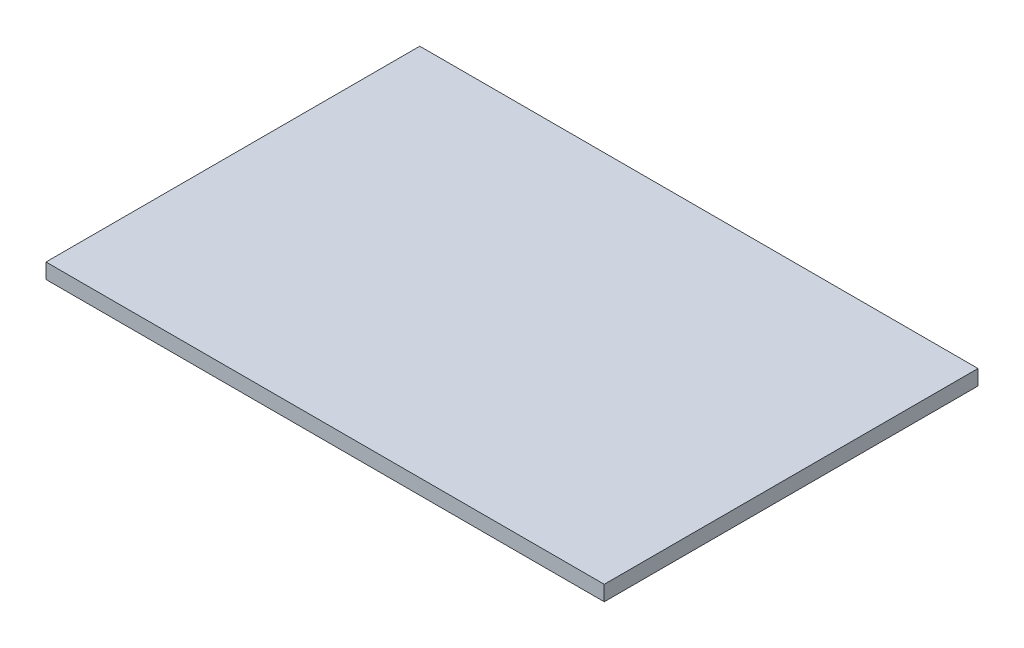
ISO-10303-21;
HEADER;
FILE_DESCRIPTION(('STEP AP214'),'2;1');
FILE_NAME('part.step','',(''),(''),'','','');
FILE_SCHEMA(('AUTOMOTIVE_DESIGN { 1 0 10303 214 1 1 1 1 }'));
ENDSEC;
DATA;
#1=APPLICATION_CONTEXT('core data for automotive mechanical design processes');
#2=APPLICATION_PROTOCOL_DEFINITION('international standard','automotive_design',2000,#1);
#3=PRODUCT_CONTEXT('',#1,'mechanical');
#4=PRODUCT('Part','Part','',(#3));
#5=PRODUCT_RELATED_PRODUCT_CATEGORY('part','',(#4));
#6=PRODUCT_DEFINITION_FORMATION('','',#4);
#7=PRODUCT_DEFINITION_CONTEXT('part definition',#1,'design');
#8=PRODUCT_DEFINITION('design','',#6,#7);
#9=PRODUCT_DEFINITION_SHAPE('','',#8);
#10=(LENGTH_UNIT() NAMED_UNIT(*) SI_UNIT(.MILLI.,.METRE.));
#11=(NAMED_UNIT(*) PLANE_ANGLE_UNIT() SI_UNIT($,.RADIAN.));
#12=(NAMED_UNIT(*) SI_UNIT($,.STERADIAN.) SOLID_ANGLE_UNIT());
#13=UNCERTAINTY_MEASURE_WITH_UNIT(LENGTH_MEASURE(1.E-05),#10,'distance_accuracy_value','');
#14=(GEOMETRIC_REPRESENTATION_CONTEXT(3) GLOBAL_UNCERTAINTY_ASSIGNED_CONTEXT((#13)) GLOBAL_UNIT_ASSIGNED_CONTEXT((#10,
#11,#12)) REPRESENTATION_CONTEXT('',''));
#15=CARTESIAN_POINT('',(0.,0.,0.));
#16=DIRECTION('',(0.,0.,1.));
#17=DIRECTION('',(1.,0.,0.));
#18=AXIS2_PLACEMENT_3D('',#15,#16,#17);
#19=CARTESIAN_POINT('',(-3.7338,0.1016,5.00000016));
#20=DIRECTION('',(0.,0.,1.));
#21=DIRECTION('',(1.,0.,0.));
#22=AXIS2_PLACEMENT_3D('',#19,#20,#21);
#23=PLANE('',#22);
#24=DIRECTION('',(1.,0.,0.));
#25=VECTOR('',#24,1.);
#26=CARTESIAN_POINT('',(-3.7338,0.1016,5.00000016));
#27=LINE('',#26,#25);
#28=CARTESIAN_POINT('',(-3.7338,0.1016,5.00000016));
#29=VERTEX_POINT('',#28);
#30=CARTESIAN_POINT('',(3.7338,0.1016,5.00000016));
#31=VERTEX_POINT('',#30);
#32=EDGE_CURVE('E101',#29,#31,#27,.T.);
#33=ORIENTED_EDGE('',*,*,#32,.F.);
#34=DIRECTION('',(0.,1.,0.));
#35=VECTOR('',#34,1.);
#36=CARTESIAN_POINT('',(-3.7338,-0.1016,5.00000016));
#37=LINE('',#36,#35);
#38=CARTESIAN_POINT('',(-3.7338,-0.1016,5.00000016));
#39=VERTEX_POINT('',#38);
#40=EDGE_CURVE('E28',#39,#29,#37,.T.);
#41=ORIENTED_EDGE('',*,*,#40,.F.);
#42=DIRECTION('',(-1.,0.,0.));
#43=VECTOR('',#42,1.);
#44=CARTESIAN_POINT('',(3.7338,-0.1016,5.00000016));
#45=LINE('',#44,#43);
#46=CARTESIAN_POINT('',(3.7338,-0.1016,5.00000016));
#47=VERTEX_POINT('',#46);
#48=EDGE_CURVE('E67',#47,#39,#45,.T.);
#49=ORIENTED_EDGE('',*,*,#48,.F.);
#50=DIRECTION('',(0.,-1.,0.));
#51=VECTOR('',#50,1.);
#52=CARTESIAN_POINT('',(3.7338,0.1016,5.00000016));
#53=LINE('',#52,#51);
#54=EDGE_CURVE('E71',#31,#47,#53,.T.);
#55=ORIENTED_EDGE('',*,*,#54,.F.);
#56=EDGE_LOOP('',(#33,#41,#49,#55));
#57=FACE_BOUND('',#56,.T.);
#58=ADVANCED_FACE('F17',(#57),#23,.T.);
#59=CARTESIAN_POINT('',(-3.7338,0.1016,0.));
#60=DIRECTION('',(0.,0.,1.));
#61=DIRECTION('',(1.,0.,0.));
#62=AXIS2_PLACEMENT_3D('',#59,#60,#61);
#63=PLANE('',#62);
#64=DIRECTION('',(1.,0.,0.));
#65=VECTOR('',#64,1.);
#66=CARTESIAN_POINT('',(-3.7338,0.1016,0.));
#67=LINE('',#66,#65);
#68=CARTESIAN_POINT('',(-3.7338,0.1016,0.));
#69=VERTEX_POINT('',#68);
#70=CARTESIAN_POINT('',(3.7338,0.1016,0.));
#71=VERTEX_POINT('',#70);
#72=EDGE_CURVE('E91',#69,#71,#67,.T.);
#73=ORIENTED_EDGE('',*,*,#72,.T.);
#74=DIRECTION('',(0.,-1.,0.));
#75=VECTOR('',#74,1.);
#76=CARTESIAN_POINT('',(3.7338,0.1016,0.));
#77=LINE('',#76,#75);
#78=CARTESIAN_POINT('',(3.7338,-0.1016,0.));
#79=VERTEX_POINT('',#78);
#80=EDGE_CURVE('E77',#71,#79,#77,.T.);
#81=ORIENTED_EDGE('',*,*,#80,.T.);
#82=DIRECTION('',(-1.,0.,0.));
#83=VECTOR('',#82,1.);
#84=CARTESIAN_POINT('',(3.7338,-0.1016,0.));
#85=LINE('',#84,#83);
#86=CARTESIAN_POINT('',(-3.7338,-0.1016,0.));
#87=VERTEX_POINT('',#86);
#88=EDGE_CURVE('E21',#79,#87,#85,.T.);
#89=ORIENTED_EDGE('',*,*,#88,.T.);
#90=DIRECTION('',(0.,1.,0.));
#91=VECTOR('',#90,1.);
#92=CARTESIAN_POINT('',(-3.7338,-0.1016,0.));
#93=LINE('',#92,#91);
#94=EDGE_CURVE('E11',#87,#69,#93,.T.);
#95=ORIENTED_EDGE('',*,*,#94,.T.);
#96=EDGE_LOOP('',(#73,#81,#89,#95));
#97=FACE_BOUND('',#96,.T.);
#98=ADVANCED_FACE('F19',(#97),#63,.F.);
#99=CARTESIAN_POINT('',(-3.7338,-0.1016,0.));
#100=DIRECTION('',(-1.,0.,0.));
#101=DIRECTION('',(0.,0.,1.));
#102=AXIS2_PLACEMENT_3D('',#99,#100,#101);
#103=PLANE('',#102);
#104=DIRECTION('',(0.,0.,1.));
#105=VECTOR('',#104,1.);
#106=CARTESIAN_POINT('',(-3.7338,-0.1016,0.));
#107=LINE('',#106,#105);
#108=EDGE_CURVE('E76',#87,#39,#107,.T.);
#109=ORIENTED_EDGE('',*,*,#108,.T.);
#110=ORIENTED_EDGE('',*,*,#40,.T.);
#111=DIRECTION('',(0.,0.,1.));
#112=VECTOR('',#111,1.);
#113=CARTESIAN_POINT('',(-3.7338,0.1016,0.));
#114=LINE('',#113,#112);
#115=EDGE_CURVE('E106',#69,#29,#114,.T.);
#116=ORIENTED_EDGE('',*,*,#115,.F.);
#117=ORIENTED_EDGE('',*,*,#94,.F.);
#118=EDGE_LOOP('',(#109,#110,#116,#117));
#119=FACE_BOUND('',#118,.T.);
#120=ADVANCED_FACE('F165',(#119),#103,.T.);
#121=CARTESIAN_POINT('',(3.7338,-0.1016,0.));
#122=DIRECTION('',(0.,-1.,0.));
#123=DIRECTION('',(0.,0.,-1.));
#124=AXIS2_PLACEMENT_3D('',#121,#122,#123);
#125=PLANE('',#124);
#126=DIRECTION('',(0.,0.,1.));
#127=VECTOR('',#126,1.);
#128=CARTESIAN_POINT('',(3.7338,-0.1016,0.));
#129=LINE('',#128,#127);
#130=EDGE_CURVE('E80',#79,#47,#129,.T.);
#131=ORIENTED_EDGE('',*,*,#130,.T.);
#132=ORIENTED_EDGE('',*,*,#48,.T.);
#133=ORIENTED_EDGE('',*,*,#108,.F.);
#134=ORIENTED_EDGE('',*,*,#88,.F.);
#135=EDGE_LOOP('',(#131,#132,#133,#134));
#136=FACE_BOUND('',#135,.T.);
#137=ADVANCED_FACE('F81',(#136),#125,.T.);
#138=CARTESIAN_POINT('',(3.7338,0.1016,0.));
#139=DIRECTION('',(1.,0.,0.));
#140=DIRECTION('',(0.,1.,0.));
#141=AXIS2_PLACEMENT_3D('',#138,#139,#140);
#142=PLANE('',#141);
#143=DIRECTION('',(0.,0.,1.));
#144=VECTOR('',#143,1.);
#145=CARTESIAN_POINT('',(3.7338,0.1016,0.));
#146=LINE('',#145,#144);
#147=EDGE_CURVE('E88',#71,#31,#146,.T.);
#148=ORIENTED_EDGE('',*,*,#147,.T.);
#149=ORIENTED_EDGE('',*,*,#54,.T.);
#150=ORIENTED_EDGE('',*,*,#130,.F.);
#151=ORIENTED_EDGE('',*,*,#80,.F.);
#152=EDGE_LOOP('',(#148,#149,#150,#151));
#153=FACE_BOUND('',#152,.T.);
#154=ADVANCED_FACE('F86',(#153),#142,.T.);
#155=CARTESIAN_POINT('',(-3.7338,0.1016,0.));
#156=DIRECTION('',(0.,1.,0.));
#157=DIRECTION('',(1.,0.,0.));
#158=AXIS2_PLACEMENT_3D('',#155,#156,#157);
#159=PLANE('',#158);
#160=ORIENTED_EDGE('',*,*,#115,.T.);
#161=ORIENTED_EDGE('',*,*,#32,.T.);
#162=ORIENTED_EDGE('',*,*,#147,.F.);
#163=ORIENTED_EDGE('',*,*,#72,.F.);
#164=EDGE_LOOP('',(#160,#161,#162,#163));
#165=FACE_BOUND('',#164,.T.);
#166=ADVANCED_FACE('F116',(#165),#159,.T.);
#167=CLOSED_SHELL('',(#58,#98,#120,#137,#154,#166));
#168=MANIFOLD_SOLID_BREP('B1',#167);
#169=ADVANCED_BREP_SHAPE_REPRESENTATION('',(#18,#168),#14);
#170=SHAPE_DEFINITION_REPRESENTATION(#9,#169);
ENDSEC;
END-ISO-10303-21;
